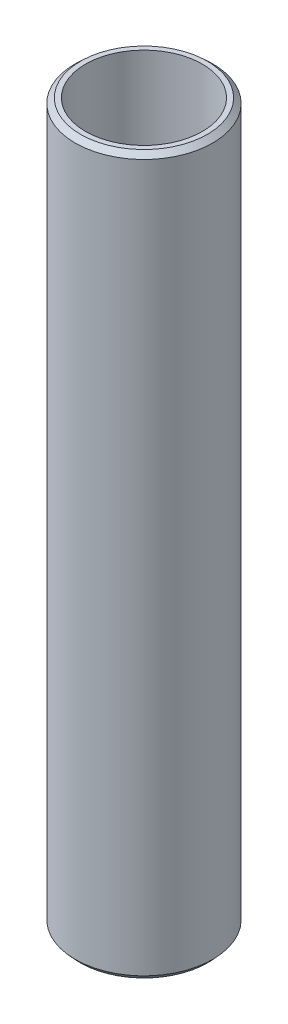
ISO-10303-21;
HEADER;
FILE_DESCRIPTION(('STEP AP214'),'2;1');
FILE_NAME('part.step','',(''),(''),'','','');
FILE_SCHEMA(('AUTOMOTIVE_DESIGN { 1 0 10303 214 1 1 1 1 }'));
ENDSEC;
DATA;
#1=APPLICATION_CONTEXT('core data for automotive mechanical design processes');
#2=APPLICATION_PROTOCOL_DEFINITION('international standard','automotive_design',2000,#1);
#3=PRODUCT_CONTEXT('',#1,'mechanical');
#4=PRODUCT('Part','Part','',(#3));
#5=PRODUCT_RELATED_PRODUCT_CATEGORY('part','',(#4));
#6=PRODUCT_DEFINITION_FORMATION('','',#4);
#7=PRODUCT_DEFINITION_CONTEXT('part definition',#1,'design');
#8=PRODUCT_DEFINITION('design','',#6,#7);
#9=PRODUCT_DEFINITION_SHAPE('','',#8);
#10=(LENGTH_UNIT() NAMED_UNIT(*) SI_UNIT(.MILLI.,.METRE.));
#11=(NAMED_UNIT(*) PLANE_ANGLE_UNIT() SI_UNIT($,.RADIAN.));
#12=(NAMED_UNIT(*) SI_UNIT($,.STERADIAN.) SOLID_ANGLE_UNIT());
#13=UNCERTAINTY_MEASURE_WITH_UNIT(LENGTH_MEASURE(1.E-05),#10,'distance_accuracy_value','');
#14=(GEOMETRIC_REPRESENTATION_CONTEXT(3) GLOBAL_UNCERTAINTY_ASSIGNED_CONTEXT((#13)) GLOBAL_UNIT_ASSIGNED_CONTEXT((#10,
#11,#12)) REPRESENTATION_CONTEXT('',''));
#15=CARTESIAN_POINT('',(0.,0.,0.));
#16=DIRECTION('',(0.,0.,1.));
#17=DIRECTION('',(1.,0.,0.));
#18=AXIS2_PLACEMENT_3D('',#15,#16,#17);
#19=CARTESIAN_POINT('',(0.,600.,0.));
#20=DIRECTION('',(0.,-1.,0.));
#21=DIRECTION('',(0.,0.,-1.));
#22=AXIS2_PLACEMENT_3D('',#19,#20,#21);
#23=CYLINDRICAL_SURFACE('',#22,57.5);
#24=CARTESIAN_POINT('',(0.,595.926529215164,0.));
#25=DIRECTION('',(0.,1.,0.));
#26=DIRECTION('',(0.,0.,1.));
#27=AXIS2_PLACEMENT_3D('',#24,#25,#26);
#28=CIRCLE('',#27,57.5);
#29=CARTESIAN_POINT('',(0.,595.926529215164,57.5));
#30=VERTEX_POINT('',#29);
#31=EDGE_CURVE('E50',#30,#30,#28,.F.);
#32=ORIENTED_EDGE('',*,*,#31,.T.);
#33=EDGE_LOOP('',(#32));
#34=FACE_BOUND('',#33,.T.);
#35=CARTESIAN_POINT('',(0.,4.44539108004771,0.));
#36=DIRECTION('',(0.,1.,0.));
#37=DIRECTION('',(0.,0.,1.));
#38=AXIS2_PLACEMENT_3D('',#35,#36,#37);
#39=CIRCLE('',#38,57.5);
#40=CARTESIAN_POINT('',(0.,4.44539108004771,57.5));
#41=VERTEX_POINT('',#40);
#42=EDGE_CURVE('E51',#41,#41,#39,.T.);
#43=ORIENTED_EDGE('',*,*,#42,.T.);
#44=EDGE_LOOP('',(#43));
#45=FACE_BOUND('',#44,.T.);
#46=ADVANCED_FACE('F39',(#34,#45),#23,.T.);
#47=CARTESIAN_POINT('',(0.,600.,0.));
#48=DIRECTION('',(0.,1.,0.));
#49=DIRECTION('',(0.,0.,1.));
#50=AXIS2_PLACEMENT_3D('',#47,#48,#49);
#51=PLANE('',#50);
#52=CARTESIAN_POINT('',(0.,600.,0.));
#53=DIRECTION('',(0.,1.,0.));
#54=DIRECTION('',(0.,0.,1.));
#55=AXIS2_PLACEMENT_3D('',#52,#53,#54);
#56=CIRCLE('',#55,53.0546089199522);
#57=CARTESIAN_POINT('',(0.,600.,53.0546089199522));
#58=VERTEX_POINT('',#57);
#59=EDGE_CURVE('E54',#58,#58,#56,.T.);
#60=ORIENTED_EDGE('',*,*,#59,.T.);
#61=EDGE_LOOP('',(#60));
#62=FACE_BOUND('',#61,.T.);
#63=CARTESIAN_POINT('',(0.,600.,0.));
#64=DIRECTION('',(0.,1.,0.));
#65=DIRECTION('',(0.,0.,1.));
#66=AXIS2_PLACEMENT_3D('',#63,#64,#65);
#67=CIRCLE('',#66,48.86978917089);
#68=CARTESIAN_POINT('',(0.,600.,48.86978917089));
#69=VERTEX_POINT('',#68);
#70=EDGE_CURVE('E58',#69,#69,#67,.T.);
#71=ORIENTED_EDGE('',*,*,#70,.F.);
#72=EDGE_LOOP('',(#71));
#73=FACE_BOUND('',#72,.T.);
#74=ADVANCED_FACE('F69',(#62,#73),#51,.T.);
#75=CARTESIAN_POINT('',(0.,0.,0.));
#76=DIRECTION('',(0.,1.,0.));
#77=DIRECTION('',(0.,0.,1.));
#78=AXIS2_PLACEMENT_3D('',#75,#76,#77);
#79=PLANE('',#78);
#80=CARTESIAN_POINT('',(0.,0.,0.));
#81=DIRECTION('',(0.,1.,0.));
#82=DIRECTION('',(0.,0.,1.));
#83=AXIS2_PLACEMENT_3D('',#80,#81,#82);
#84=CIRCLE('',#83,53.4265292151639);
#85=CARTESIAN_POINT('',(0.,0.,53.4265292151639));
#86=VERTEX_POINT('',#85);
#87=EDGE_CURVE('E10',#86,#86,#84,.F.);
#88=ORIENTED_EDGE('',*,*,#87,.T.);
#89=EDGE_LOOP('',(#88));
#90=FACE_BOUND('',#89,.T.);
#91=CARTESIAN_POINT('',(0.,0.,0.));
#92=DIRECTION('',(0.,1.,0.));
#93=DIRECTION('',(0.,0.,1.));
#94=AXIS2_PLACEMENT_3D('',#91,#92,#93);
#95=CIRCLE('',#94,48.86978917089);
#96=CARTESIAN_POINT('',(0.,0.,48.86978917089));
#97=VERTEX_POINT('',#96);
#98=EDGE_CURVE('E63',#97,#97,#95,.T.);
#99=ORIENTED_EDGE('',*,*,#98,.T.);
#100=EDGE_LOOP('',(#99));
#101=FACE_BOUND('',#100,.T.);
#102=ADVANCED_FACE('F75',(#90,#101),#79,.F.);
#103=CARTESIAN_POINT('',(0.,600.,0.));
#104=DIRECTION('',(0.,-1.,0.));
#105=DIRECTION('',(0.,0.,-1.));
#106=AXIS2_PLACEMENT_3D('',#103,#104,#105);
#107=CYLINDRICAL_SURFACE('',#106,48.86978917089);
#108=ORIENTED_EDGE('',*,*,#70,.T.);
#109=EDGE_LOOP('',(#108));
#110=FACE_BOUND('',#109,.T.);
#111=ORIENTED_EDGE('',*,*,#98,.F.);
#112=EDGE_LOOP('',(#111));
#113=FACE_BOUND('',#112,.T.);
#114=ADVANCED_FACE('F70',(#110,#113),#107,.F.);
#115=CARTESIAN_POINT('',(0.,600.,0.));
#116=DIRECTION('',(0.,-1.,0.));
#117=DIRECTION('',(0.,0.,-1.));
#118=AXIS2_PLACEMENT_3D('',#115,#116,#117);
#119=CONICAL_SURFACE('',#118,53.0546089199522,0.829028905410009);
#120=ORIENTED_EDGE('',*,*,#31,.F.);
#121=EDGE_LOOP('',(#120));
#122=FACE_BOUND('',#121,.T.);
#123=ORIENTED_EDGE('',*,*,#59,.F.);
#124=EDGE_LOOP('',(#123));
#125=FACE_BOUND('',#124,.T.);
#126=ADVANCED_FACE('F81',(#122,#125),#119,.T.);
#127=CARTESIAN_POINT('',(0.,4.44539108004771,0.));
#128=DIRECTION('',(0.,1.,0.));
#129=DIRECTION('',(0.,0.,1.));
#130=AXIS2_PLACEMENT_3D('',#127,#128,#129);
#131=CONICAL_SURFACE('',#130,57.5,0.741767421384881);
#132=ORIENTED_EDGE('',*,*,#87,.F.);
#133=EDGE_LOOP('',(#132));
#134=FACE_BOUND('',#133,.T.);
#135=ORIENTED_EDGE('',*,*,#42,.F.);
#136=EDGE_LOOP('',(#135));
#137=FACE_BOUND('',#136,.T.);
#138=ADVANCED_FACE('F45',(#134,#137),#131,.T.);
#139=CLOSED_SHELL('',(#46,#74,#102,#114,#126,#138));
#140=MANIFOLD_SOLID_BREP('B2',#139);
#141=ADVANCED_BREP_SHAPE_REPRESENTATION('',(#18,#140),#14);
#142=SHAPE_DEFINITION_REPRESENTATION(#9,#141);
ENDSEC;
END-ISO-10303-21;
